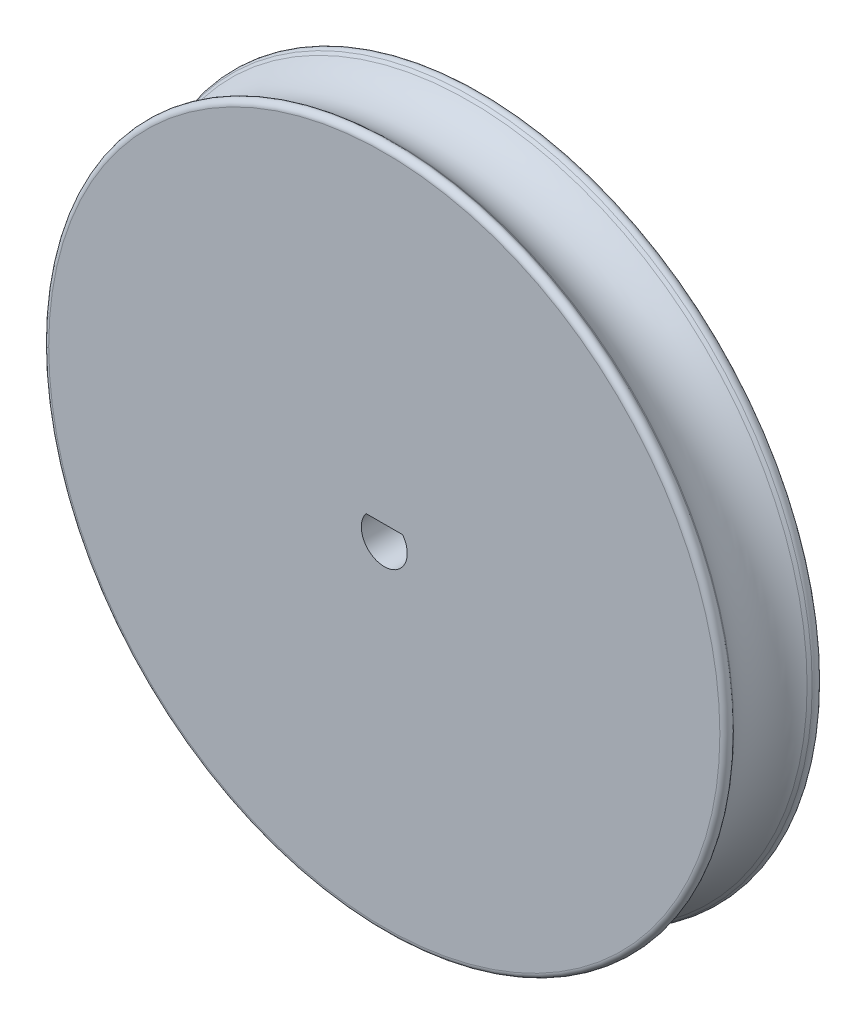
ISO-10303-21;
HEADER;
FILE_DESCRIPTION(('STEP AP214'),'2;1');
FILE_NAME('part.step','',(''),(''),'','','');
FILE_SCHEMA(('AUTOMOTIVE_DESIGN { 1 0 10303 214 1 1 1 1 }'));
ENDSEC;
DATA;
#1=APPLICATION_CONTEXT('core data for automotive mechanical design processes');
#2=APPLICATION_PROTOCOL_DEFINITION('international standard','automotive_design',2000,#1);
#3=PRODUCT_CONTEXT('',#1,'mechanical');
#4=PRODUCT('Part','Part','',(#3));
#5=PRODUCT_RELATED_PRODUCT_CATEGORY('part','',(#4));
#6=PRODUCT_DEFINITION_FORMATION('','',#4);
#7=PRODUCT_DEFINITION_CONTEXT('part definition',#1,'design');
#8=PRODUCT_DEFINITION('design','',#6,#7);
#9=PRODUCT_DEFINITION_SHAPE('','',#8);
#10=(LENGTH_UNIT() NAMED_UNIT(*) SI_UNIT(.MILLI.,.METRE.));
#11=(NAMED_UNIT(*) PLANE_ANGLE_UNIT() SI_UNIT($,.RADIAN.));
#12=(NAMED_UNIT(*) SI_UNIT($,.STERADIAN.) SOLID_ANGLE_UNIT());
#13=UNCERTAINTY_MEASURE_WITH_UNIT(LENGTH_MEASURE(1.E-05),#10,'distance_accuracy_value','');
#14=(GEOMETRIC_REPRESENTATION_CONTEXT(3) GLOBAL_UNCERTAINTY_ASSIGNED_CONTEXT((#13)) GLOBAL_UNIT_ASSIGNED_CONTEXT((#10,
#11,#12)) REPRESENTATION_CONTEXT('',''));
#15=CARTESIAN_POINT('',(0.,0.,0.));
#16=DIRECTION('',(0.,0.,1.));
#17=DIRECTION('',(1.,0.,0.));
#18=AXIS2_PLACEMENT_3D('',#15,#16,#17);
#19=CARTESIAN_POINT('',(0.,0.,7.));
#20=DIRECTION('',(0.,0.,1.));
#21=DIRECTION('',(1.,0.,0.));
#22=AXIS2_PLACEMENT_3D('',#19,#20,#21);
#23=PLANE('',#22);
#24=CARTESIAN_POINT('',(0.,0.,7.));
#25=DIRECTION('',(0.,0.,1.));
#26=DIRECTION('',(1.,0.,0.));
#27=AXIS2_PLACEMENT_3D('',#24,#25,#26);
#28=CIRCLE('',#27,24.11048825403);
#29=CARTESIAN_POINT('',(24.11048825403,0.,7.));
#30=VERTEX_POINT('',#29);
#31=EDGE_CURVE('E52',#30,#30,#28,.T.);
#32=ORIENTED_EDGE('',*,*,#31,.T.);
#33=EDGE_LOOP('',(#32));
#34=FACE_BOUND('',#33,.T.);
#35=CARTESIAN_POINT('',(0.,0.,7.));
#36=DIRECTION('',(0.,0.,1.));
#37=DIRECTION('',(1.,0.,0.));
#38=AXIS2_PLACEMENT_3D('',#35,#36,#37);
#39=CIRCLE('',#38,1.65);
#40=CARTESIAN_POINT('',(-1.31411567222981,0.997797574661314,7.));
#41=VERTEX_POINT('',#40);
#42=CARTESIAN_POINT('',(1.31411567222981,0.997797574661314,7.));
#43=VERTEX_POINT('',#42);
#44=EDGE_CURVE('E46',#41,#43,#39,.T.);
#45=ORIENTED_EDGE('',*,*,#44,.F.);
#46=DIRECTION('',(1.,0.,0.));
#47=VECTOR('',#46,1.);
#48=CARTESIAN_POINT('',(-1.12,0.997797574661314,7.));
#49=LINE('',#48,#47);
#50=EDGE_CURVE('E71',#41,#43,#49,.T.);
#51=ORIENTED_EDGE('',*,*,#50,.T.);
#52=EDGE_LOOP('',(#45,#51));
#53=FACE_BOUND('',#52,.T.);
#54=ADVANCED_FACE('F42',(#34,#53),#23,.T.);
#55=CARTESIAN_POINT('',(0.,0.,0.));
#56=DIRECTION('',(0.,0.,1.));
#57=DIRECTION('',(1.,0.,0.));
#58=AXIS2_PLACEMENT_3D('',#55,#56,#57);
#59=PLANE('',#58);
#60=CARTESIAN_POINT('',(0.,0.,0.));
#61=DIRECTION('',(0.,0.,1.));
#62=DIRECTION('',(1.,0.,0.));
#63=AXIS2_PLACEMENT_3D('',#60,#61,#62);
#64=CIRCLE('',#63,24.11048825403);
#65=CARTESIAN_POINT('',(24.11048825403,0.,0.));
#66=VERTEX_POINT('',#65);
#67=EDGE_CURVE('E92',#66,#66,#64,.F.);
#68=ORIENTED_EDGE('',*,*,#67,.T.);
#69=EDGE_LOOP('',(#68));
#70=FACE_BOUND('',#69,.T.);
#71=CARTESIAN_POINT('',(0.,0.,0.));
#72=DIRECTION('',(0.,0.,1.));
#73=DIRECTION('',(1.,0.,0.));
#74=AXIS2_PLACEMENT_3D('',#71,#72,#73);
#75=CIRCLE('',#74,1.65);
#76=CARTESIAN_POINT('',(-1.31411567222981,0.997797574661314,0.));
#77=VERTEX_POINT('',#76);
#78=CARTESIAN_POINT('',(1.31411567222981,0.997797574661314,0.));
#79=VERTEX_POINT('',#78);
#80=EDGE_CURVE('E61',#77,#79,#75,.T.);
#81=ORIENTED_EDGE('',*,*,#80,.T.);
#82=DIRECTION('',(1.,0.,0.));
#83=VECTOR('',#82,1.);
#84=CARTESIAN_POINT('',(-1.12,0.997797574661314,0.));
#85=LINE('',#84,#83);
#86=EDGE_CURVE('E78',#77,#79,#85,.T.);
#87=ORIENTED_EDGE('',*,*,#86,.F.);
#88=EDGE_LOOP('',(#81,#87));
#89=FACE_BOUND('',#88,.T.);
#90=ADVANCED_FACE('F98',(#70,#89),#59,.F.);
#91=CARTESIAN_POINT('',(0.,0.,7.));
#92=DIRECTION('',(0.,0.,-1.));
#93=DIRECTION('',(-1.,0.,0.));
#94=AXIS2_PLACEMENT_3D('',#91,#92,#93);
#95=CYLINDRICAL_SURFACE('',#94,1.65);
#96=DIRECTION('',(0.,0.,-1.));
#97=VECTOR('',#96,1.);
#98=CARTESIAN_POINT('',(-1.31411567222981,0.997797574661314,7.));
#99=LINE('',#98,#97);
#100=EDGE_CURVE('E73',#77,#41,#99,.F.);
#101=ORIENTED_EDGE('',*,*,#100,.T.);
#102=ORIENTED_EDGE('',*,*,#44,.T.);
#103=DIRECTION('',(0.,0.,-1.));
#104=VECTOR('',#103,1.);
#105=CARTESIAN_POINT('',(1.31411567222981,0.997797574661314,7.));
#106=LINE('',#105,#104);
#107=EDGE_CURVE('E77',#79,#43,#106,.F.);
#108=ORIENTED_EDGE('',*,*,#107,.F.);
#109=ORIENTED_EDGE('',*,*,#80,.F.);
#110=EDGE_LOOP('',(#101,#102,#108,#109));
#111=FACE_BOUND('',#110,.T.);
#112=ADVANCED_FACE('F44',(#111),#95,.F.);
#113=CARTESIAN_POINT('',(0.,0.,7.));
#114=DIRECTION('',(0.,0.,1.));
#115=DIRECTION('',(1.,0.,0.));
#116=AXIS2_PLACEMENT_3D('',#113,#114,#115);
#117=CONICAL_SURFACE('',#116,25.,0.725612612166866);
#118=CARTESIAN_POINT('',(0.,0.,6.33456245677912));
#119=DIRECTION('',(0.,0.,-1.));
#120=DIRECTION('',(-1.,0.,0.));
#121=AXIS2_PLACEMENT_3D('',#118,#119,#120);
#122=CIRCLE('',#121,24.409725468709);
#123=CARTESIAN_POINT('',(-24.409725468709,0.,6.33456245677912));
#124=VERTEX_POINT('',#123);
#125=EDGE_CURVE('E12',#124,#124,#122,.T.);
#126=ORIENTED_EDGE('',*,*,#125,.T.);
#127=EDGE_LOOP('',(#126));
#128=FACE_BOUND('',#127,.T.);
#129=CARTESIAN_POINT('',(0.,0.,6.13988711743194));
#130=DIRECTION('',(0.,0.,1.));
#131=DIRECTION('',(1.,0.,0.));
#132=AXIS2_PLACEMENT_3D('',#129,#130,#131);
#133=CIRCLE('',#132,24.2370392476538);
#134=CARTESIAN_POINT('',(24.2370392476538,0.,6.13988711743194));
#135=VERTEX_POINT('',#134);
#136=EDGE_CURVE('E87',#135,#135,#133,.T.);
#137=ORIENTED_EDGE('',*,*,#136,.T.);
#138=EDGE_LOOP('',(#137));
#139=FACE_BOUND('',#138,.T.);
#140=ADVANCED_FACE('F106',(#128,#139),#117,.T.);
#141=CARTESIAN_POINT('',(0.,0.,3.5));
#142=DIRECTION('',(0.,0.,1.));
#143=DIRECTION('',(1.,0.,0.));
#144=AXIS2_PLACEMENT_3D('',#141,#142,#143);
#145=TOROIDAL_SURFACE('',#144,26.7400520834517,3.6378671290953);
#146=CARTESIAN_POINT('',(0.,0.,0.860112882568064));
#147=DIRECTION('',(0.,0.,1.));
#148=DIRECTION('',(1.,0.,0.));
#149=AXIS2_PLACEMENT_3D('',#146,#147,#148);
#150=CIRCLE('',#149,24.2370392476538);
#151=CARTESIAN_POINT('',(24.2370392476538,0.,0.860112882568064));
#152=VERTEX_POINT('',#151);
#153=EDGE_CURVE('E84',#152,#152,#150,.T.);
#154=ORIENTED_EDGE('',*,*,#153,.T.);
#155=EDGE_LOOP('',(#154));
#156=FACE_BOUND('',#155,.T.);
#157=ORIENTED_EDGE('',*,*,#136,.F.);
#158=EDGE_LOOP('',(#157));
#159=FACE_BOUND('',#158,.T.);
#160=ADVANCED_FACE('F128',(#156,#159),#145,.F.);
#161=CARTESIAN_POINT('',(0.,0.,0.860112882568064));
#162=DIRECTION('',(0.,0.,-1.));
#163=DIRECTION('',(-1.,0.,0.));
#164=AXIS2_PLACEMENT_3D('',#161,#162,#163);
#165=CONICAL_SURFACE('',#164,24.2370392476538,0.725612612166866);
#166=CARTESIAN_POINT('',(0.,0.,0.665437543220876));
#167=DIRECTION('',(0.,0.,-1.));
#168=DIRECTION('',(-1.,0.,0.));
#169=AXIS2_PLACEMENT_3D('',#166,#167,#168);
#170=CIRCLE('',#169,24.409725468709);
#171=CARTESIAN_POINT('',(-24.409725468709,0.,0.665437543220876));
#172=VERTEX_POINT('',#171);
#173=EDGE_CURVE('E72',#172,#172,#170,.F.);
#174=ORIENTED_EDGE('',*,*,#173,.T.);
#175=EDGE_LOOP('',(#174));
#176=FACE_BOUND('',#175,.T.);
#177=ORIENTED_EDGE('',*,*,#153,.F.);
#178=EDGE_LOOP('',(#177));
#179=FACE_BOUND('',#178,.T.);
#180=ADVANCED_FACE('F114',(#176,#179),#165,.T.);
#181=CARTESIAN_POINT('',(0.,0.,0.4));
#182=DIRECTION('',(0.,0.,1.));
#183=DIRECTION('',(1.,0.,0.));
#184=AXIS2_PLACEMENT_3D('',#181,#182,#183);
#185=TOROIDAL_SURFACE('',#184,24.11048825403,0.4);
#186=ORIENTED_EDGE('',*,*,#67,.F.);
#187=EDGE_LOOP('',(#186));
#188=FACE_BOUND('',#187,.T.);
#189=ORIENTED_EDGE('',*,*,#173,.F.);
#190=EDGE_LOOP('',(#189));
#191=FACE_BOUND('',#190,.T.);
#192=ADVANCED_FACE('F111',(#188,#191),#185,.T.);
#193=CARTESIAN_POINT('',(0.,0.,6.6));
#194=DIRECTION('',(0.,0.,1.));
#195=DIRECTION('',(1.,0.,0.));
#196=AXIS2_PLACEMENT_3D('',#193,#194,#195);
#197=TOROIDAL_SURFACE('',#196,24.11048825403,0.4);
#198=ORIENTED_EDGE('',*,*,#125,.F.);
#199=EDGE_LOOP('',(#198));
#200=FACE_BOUND('',#199,.T.);
#201=ORIENTED_EDGE('',*,*,#31,.F.);
#202=EDGE_LOOP('',(#201));
#203=FACE_BOUND('',#202,.T.);
#204=ADVANCED_FACE('F113',(#200,#203),#197,.T.);
#205=CARTESIAN_POINT('',(-1.12,0.997797574661314,0.));
#206=DIRECTION('',(0.,-1.,0.));
#207=DIRECTION('',(0.,0.,-1.));
#208=AXIS2_PLACEMENT_3D('',#205,#206,#207);
#209=PLANE('',#208);
#210=ORIENTED_EDGE('',*,*,#50,.F.);
#211=ORIENTED_EDGE('',*,*,#100,.F.);
#212=ORIENTED_EDGE('',*,*,#86,.T.);
#213=ORIENTED_EDGE('',*,*,#107,.T.);
#214=EDGE_LOOP('',(#210,#211,#212,#213));
#215=FACE_BOUND('',#214,.T.);
#216=ADVANCED_FACE('F80',(#215),#209,.T.);
#217=CLOSED_SHELL('',(#54,#90,#112,#140,#160,#180,#192,#204,#216));
#218=MANIFOLD_SOLID_BREP('B2',#217);
#219=ADVANCED_BREP_SHAPE_REPRESENTATION('',(#18,#218),#14);
#220=SHAPE_DEFINITION_REPRESENTATION(#9,#219);
ENDSEC;
END-ISO-10303-21;
